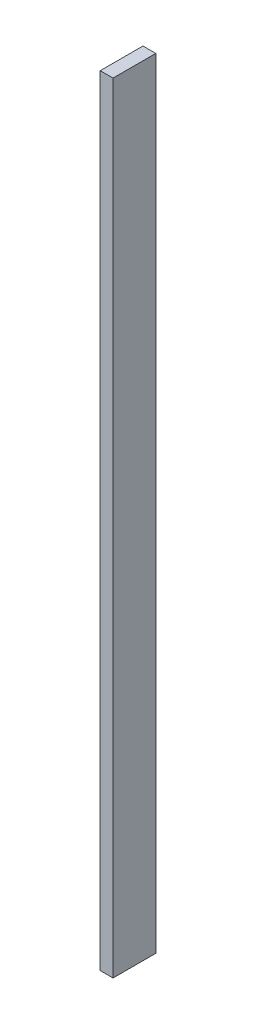
ISO-10303-21;
HEADER;
FILE_DESCRIPTION(('STEP AP214'),'2;1');
FILE_NAME('part.step','',(''),(''),'','','');
FILE_SCHEMA(('AUTOMOTIVE_DESIGN { 1 0 10303 214 1 1 1 1 }'));
ENDSEC;
DATA;
#1=APPLICATION_CONTEXT('core data for automotive mechanical design processes');
#2=APPLICATION_PROTOCOL_DEFINITION('international standard','automotive_design',2000,#1);
#3=PRODUCT_CONTEXT('',#1,'mechanical');
#4=PRODUCT('Part','Part','',(#3));
#5=PRODUCT_RELATED_PRODUCT_CATEGORY('part','',(#4));
#6=PRODUCT_DEFINITION_FORMATION('','',#4);
#7=PRODUCT_DEFINITION_CONTEXT('part definition',#1,'design');
#8=PRODUCT_DEFINITION('design','',#6,#7);
#9=PRODUCT_DEFINITION_SHAPE('','',#8);
#10=(LENGTH_UNIT() NAMED_UNIT(*) SI_UNIT(.MILLI.,.METRE.));
#11=(NAMED_UNIT(*) PLANE_ANGLE_UNIT() SI_UNIT($,.RADIAN.));
#12=(NAMED_UNIT(*) SI_UNIT($,.STERADIAN.) SOLID_ANGLE_UNIT());
#13=UNCERTAINTY_MEASURE_WITH_UNIT(LENGTH_MEASURE(1.E-05),#10,'distance_accuracy_value','');
#14=(GEOMETRIC_REPRESENTATION_CONTEXT(3) GLOBAL_UNCERTAINTY_ASSIGNED_CONTEXT((#13)) GLOBAL_UNIT_ASSIGNED_CONTEXT((#10,
#11,#12)) REPRESENTATION_CONTEXT('',''));
#15=CARTESIAN_POINT('',(0.,0.,0.));
#16=DIRECTION('',(0.,0.,1.));
#17=DIRECTION('',(1.,0.,0.));
#18=AXIS2_PLACEMENT_3D('',#15,#16,#17);
#19=CARTESIAN_POINT('',(1.5,182.4,5.00000000000001));
#20=DIRECTION('',(-1.,0.,0.));
#21=DIRECTION('',(0.,0.,1.));
#22=AXIS2_PLACEMENT_3D('',#19,#20,#21);
#23=PLANE('',#22);
#24=DIRECTION('',(0.,0.,-1.));
#25=VECTOR('',#24,1.);
#26=CARTESIAN_POINT('',(1.5,0.,5.00000000000001));
#27=LINE('',#26,#25);
#28=CARTESIAN_POINT('',(1.5,0.,5.00000000000001));
#29=VERTEX_POINT('',#28);
#30=CARTESIAN_POINT('',(1.5,0.,-4.99999999999999));
#31=VERTEX_POINT('',#30);
#32=EDGE_CURVE('E98',#29,#31,#27,.T.);
#33=ORIENTED_EDGE('',*,*,#32,.T.);
#34=DIRECTION('',(0.,-1.,0.));
#35=VECTOR('',#34,1.);
#36=CARTESIAN_POINT('',(1.5,182.4,-4.99999999999999));
#37=LINE('',#36,#35);
#38=CARTESIAN_POINT('',(1.5,182.4,-4.99999999999999));
#39=VERTEX_POINT('',#38);
#40=EDGE_CURVE('E11',#39,#31,#37,.T.);
#41=ORIENTED_EDGE('',*,*,#40,.F.);
#42=DIRECTION('',(0.,0.,-1.));
#43=VECTOR('',#42,1.);
#44=CARTESIAN_POINT('',(1.5,182.4,5.00000000000001));
#45=LINE('',#44,#43);
#46=CARTESIAN_POINT('',(1.5,182.4,5.00000000000001));
#47=VERTEX_POINT('',#46);
#48=EDGE_CURVE('E86',#47,#39,#45,.T.);
#49=ORIENTED_EDGE('',*,*,#48,.F.);
#50=DIRECTION('',(0.,-1.,0.));
#51=VECTOR('',#50,1.);
#52=CARTESIAN_POINT('',(1.5,182.4,5.00000000000001));
#53=LINE('',#52,#51);
#54=EDGE_CURVE('E94',#47,#29,#53,.T.);
#55=ORIENTED_EDGE('',*,*,#54,.T.);
#56=EDGE_LOOP('',(#33,#41,#49,#55));
#57=FACE_BOUND('',#56,.T.);
#58=ADVANCED_FACE('F35',(#57),#23,.F.);
#59=CARTESIAN_POINT('',(-1.5,182.4,-4.99999999999999));
#60=DIRECTION('',(0.,0.,1.));
#61=DIRECTION('',(1.,0.,0.));
#62=AXIS2_PLACEMENT_3D('',#59,#60,#61);
#63=PLANE('',#62);
#64=DIRECTION('',(-1.,0.,0.));
#65=VECTOR('',#64,1.);
#66=CARTESIAN_POINT('',(-1.5,0.,-4.99999999999999));
#67=LINE('',#66,#65);
#68=CARTESIAN_POINT('',(-1.5,0.,-4.99999999999999));
#69=VERTEX_POINT('',#68);
#70=EDGE_CURVE('E90',#31,#69,#67,.T.);
#71=ORIENTED_EDGE('',*,*,#70,.T.);
#72=DIRECTION('',(0.,-1.,0.));
#73=VECTOR('',#72,1.);
#74=CARTESIAN_POINT('',(-1.5,182.4,-4.99999999999999));
#75=LINE('',#74,#73);
#76=CARTESIAN_POINT('',(-1.5,182.4,-4.99999999999999));
#77=VERTEX_POINT('',#76);
#78=EDGE_CURVE('E43',#77,#69,#75,.T.);
#79=ORIENTED_EDGE('',*,*,#78,.F.);
#80=DIRECTION('',(-1.,0.,0.));
#81=VECTOR('',#80,1.);
#82=CARTESIAN_POINT('',(-1.5,182.4,-4.99999999999999));
#83=LINE('',#82,#81);
#84=EDGE_CURVE('E81',#39,#77,#83,.T.);
#85=ORIENTED_EDGE('',*,*,#84,.F.);
#86=ORIENTED_EDGE('',*,*,#40,.T.);
#87=EDGE_LOOP('',(#71,#79,#85,#86));
#88=FACE_BOUND('',#87,.T.);
#89=ADVANCED_FACE('F89',(#88),#63,.F.);
#90=CARTESIAN_POINT('',(-1.5,182.4,5.00000000000001));
#91=DIRECTION('',(1.,0.,0.));
#92=DIRECTION('',(0.,0.,-1.));
#93=AXIS2_PLACEMENT_3D('',#90,#91,#92);
#94=PLANE('',#93);
#95=DIRECTION('',(0.,0.,1.));
#96=VECTOR('',#95,1.);
#97=CARTESIAN_POINT('',(-1.5,0.,5.00000000000001));
#98=LINE('',#97,#96);
#99=CARTESIAN_POINT('',(-1.5,0.,5.00000000000001));
#100=VERTEX_POINT('',#99);
#101=EDGE_CURVE('E68',#69,#100,#98,.T.);
#102=ORIENTED_EDGE('',*,*,#101,.T.);
#103=DIRECTION('',(0.,-1.,0.));
#104=VECTOR('',#103,1.);
#105=CARTESIAN_POINT('',(-1.5,182.4,5.00000000000001));
#106=LINE('',#105,#104);
#107=CARTESIAN_POINT('',(-1.5,182.4,5.00000000000001));
#108=VERTEX_POINT('',#107);
#109=EDGE_CURVE('E91',#108,#100,#106,.T.);
#110=ORIENTED_EDGE('',*,*,#109,.F.);
#111=DIRECTION('',(0.,0.,1.));
#112=VECTOR('',#111,1.);
#113=CARTESIAN_POINT('',(-1.5,182.4,5.00000000000001));
#114=LINE('',#113,#112);
#115=EDGE_CURVE('E84',#77,#108,#114,.T.);
#116=ORIENTED_EDGE('',*,*,#115,.F.);
#117=ORIENTED_EDGE('',*,*,#78,.T.);
#118=EDGE_LOOP('',(#102,#110,#116,#117));
#119=FACE_BOUND('',#118,.T.);
#120=ADVANCED_FACE('F92',(#119),#94,.F.);
#121=CARTESIAN_POINT('',(-1.5,182.4,5.00000000000001));
#122=DIRECTION('',(0.,0.,-1.));
#123=DIRECTION('',(-1.,0.,0.));
#124=AXIS2_PLACEMENT_3D('',#121,#122,#123);
#125=PLANE('',#124);
#126=DIRECTION('',(1.,0.,0.));
#127=VECTOR('',#126,1.);
#128=CARTESIAN_POINT('',(-1.5,0.,5.00000000000001));
#129=LINE('',#128,#127);
#130=EDGE_CURVE('E74',#100,#29,#129,.T.);
#131=ORIENTED_EDGE('',*,*,#130,.T.);
#132=ORIENTED_EDGE('',*,*,#54,.F.);
#133=DIRECTION('',(1.,0.,0.));
#134=VECTOR('',#133,1.);
#135=CARTESIAN_POINT('',(-1.5,182.4,5.00000000000001));
#136=LINE('',#135,#134);
#137=EDGE_CURVE('E51',#108,#47,#136,.T.);
#138=ORIENTED_EDGE('',*,*,#137,.F.);
#139=ORIENTED_EDGE('',*,*,#109,.T.);
#140=EDGE_LOOP('',(#131,#132,#138,#139));
#141=FACE_BOUND('',#140,.T.);
#142=ADVANCED_FACE('F105',(#141),#125,.F.);
#143=CARTESIAN_POINT('',(0.,182.4,0.));
#144=DIRECTION('',(0.,-1.,0.));
#145=DIRECTION('',(0.,0.,-1.));
#146=AXIS2_PLACEMENT_3D('',#143,#144,#145);
#147=PLANE('',#146);
#148=ORIENTED_EDGE('',*,*,#48,.T.);
#149=ORIENTED_EDGE('',*,*,#84,.T.);
#150=ORIENTED_EDGE('',*,*,#115,.T.);
#151=ORIENTED_EDGE('',*,*,#137,.T.);
#152=EDGE_LOOP('',(#148,#149,#150,#151));
#153=FACE_BOUND('',#152,.T.);
#154=ADVANCED_FACE('F82',(#153),#147,.F.);
#155=CARTESIAN_POINT('',(0.,0.,0.));
#156=DIRECTION('',(0.,-1.,0.));
#157=DIRECTION('',(0.,0.,-1.));
#158=AXIS2_PLACEMENT_3D('',#155,#156,#157);
#159=PLANE('',#158);
#160=ORIENTED_EDGE('',*,*,#32,.F.);
#161=ORIENTED_EDGE('',*,*,#130,.F.);
#162=ORIENTED_EDGE('',*,*,#101,.F.);
#163=ORIENTED_EDGE('',*,*,#70,.F.);
#164=EDGE_LOOP('',(#160,#161,#162,#163));
#165=FACE_BOUND('',#164,.T.);
#166=ADVANCED_FACE('F108',(#165),#159,.T.);
#167=CLOSED_SHELL('',(#58,#89,#120,#142,#154,#166));
#168=MANIFOLD_SOLID_BREP('B2',#167);
#169=ADVANCED_BREP_SHAPE_REPRESENTATION('',(#18,#168),#14);
#170=SHAPE_DEFINITION_REPRESENTATION(#9,#169);
ENDSEC;
END-ISO-10303-21;
